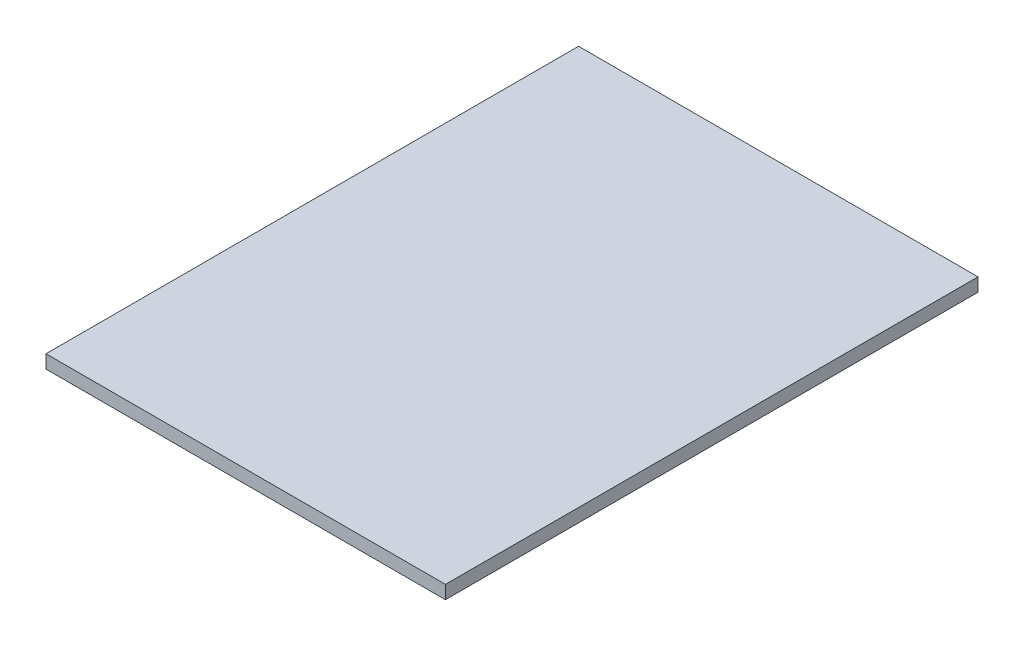
ISO-10303-21;
HEADER;
FILE_DESCRIPTION(('STEP AP214'),'2;1');
FILE_NAME('part.step','',(''),(''),'','','');
FILE_SCHEMA(('AUTOMOTIVE_DESIGN { 1 0 10303 214 1 1 1 1 }'));
ENDSEC;
DATA;
#1=APPLICATION_CONTEXT('core data for automotive mechanical design processes');
#2=APPLICATION_PROTOCOL_DEFINITION('international standard','automotive_design',2000,#1);
#3=PRODUCT_CONTEXT('',#1,'mechanical');
#4=PRODUCT('Part','Part','',(#3));
#5=PRODUCT_RELATED_PRODUCT_CATEGORY('part','',(#4));
#6=PRODUCT_DEFINITION_FORMATION('','',#4);
#7=PRODUCT_DEFINITION_CONTEXT('part definition',#1,'design');
#8=PRODUCT_DEFINITION('design','',#6,#7);
#9=PRODUCT_DEFINITION_SHAPE('','',#8);
#10=(LENGTH_UNIT() NAMED_UNIT(*) SI_UNIT(.MILLI.,.METRE.));
#11=(NAMED_UNIT(*) PLANE_ANGLE_UNIT() SI_UNIT($,.RADIAN.));
#12=(NAMED_UNIT(*) SI_UNIT($,.STERADIAN.) SOLID_ANGLE_UNIT());
#13=UNCERTAINTY_MEASURE_WITH_UNIT(LENGTH_MEASURE(1.E-05),#10,'distance_accuracy_value','');
#14=(GEOMETRIC_REPRESENTATION_CONTEXT(3) GLOBAL_UNCERTAINTY_ASSIGNED_CONTEXT((#13)) GLOBAL_UNIT_ASSIGNED_CONTEXT((#10,
#11,#12)) REPRESENTATION_CONTEXT('',''));
#15=CARTESIAN_POINT('',(0.,0.,0.));
#16=DIRECTION('',(0.,0.,1.));
#17=DIRECTION('',(1.,0.,0.));
#18=AXIS2_PLACEMENT_3D('',#15,#16,#17);
#19=CARTESIAN_POINT('',(0.,10.,0.));
#20=DIRECTION('',(1.,0.,0.));
#21=DIRECTION('',(0.,0.,-1.));
#22=AXIS2_PLACEMENT_3D('',#19,#20,#21);
#23=PLANE('',#22);
#24=DIRECTION('',(0.,0.,1.));
#25=VECTOR('',#24,1.);
#26=CARTESIAN_POINT('',(0.,0.,0.));
#27=LINE('',#26,#25);
#28=CARTESIAN_POINT('',(0.,0.,-400.));
#29=VERTEX_POINT('',#28);
#30=CARTESIAN_POINT('',(0.,0.,0.));
#31=VERTEX_POINT('',#30);
#32=EDGE_CURVE('E93',#29,#31,#27,.T.);
#33=ORIENTED_EDGE('',*,*,#32,.T.);
#34=DIRECTION('',(0.,-1.,0.));
#35=VECTOR('',#34,1.);
#36=CARTESIAN_POINT('',(0.,10.,0.));
#37=LINE('',#36,#35);
#38=CARTESIAN_POINT('',(0.,10.,0.));
#39=VERTEX_POINT('',#38);
#40=EDGE_CURVE('E11',#39,#31,#37,.T.);
#41=ORIENTED_EDGE('',*,*,#40,.F.);
#42=DIRECTION('',(0.,0.,1.));
#43=VECTOR('',#42,1.);
#44=CARTESIAN_POINT('',(0.,10.,0.));
#45=LINE('',#44,#43);
#46=CARTESIAN_POINT('',(0.,10.,-400.));
#47=VERTEX_POINT('',#46);
#48=EDGE_CURVE('E81',#47,#39,#45,.T.);
#49=ORIENTED_EDGE('',*,*,#48,.F.);
#50=DIRECTION('',(0.,-1.,0.));
#51=VECTOR('',#50,1.);
#52=CARTESIAN_POINT('',(0.,10.,-400.));
#53=LINE('',#52,#51);
#54=EDGE_CURVE('E89',#47,#29,#53,.T.);
#55=ORIENTED_EDGE('',*,*,#54,.T.);
#56=EDGE_LOOP('',(#33,#41,#49,#55));
#57=FACE_BOUND('',#56,.T.);
#58=ADVANCED_FACE('F30',(#57),#23,.F.);
#59=CARTESIAN_POINT('',(0.,10.,0.));
#60=DIRECTION('',(0.,0.,-1.));
#61=DIRECTION('',(-1.,0.,0.));
#62=AXIS2_PLACEMENT_3D('',#59,#60,#61);
#63=PLANE('',#62);
#64=DIRECTION('',(1.,0.,0.));
#65=VECTOR('',#64,1.);
#66=CARTESIAN_POINT('',(0.,0.,0.));
#67=LINE('',#66,#65);
#68=CARTESIAN_POINT('',(300.,0.,0.));
#69=VERTEX_POINT('',#68);
#70=EDGE_CURVE('E85',#31,#69,#67,.T.);
#71=ORIENTED_EDGE('',*,*,#70,.T.);
#72=DIRECTION('',(0.,-1.,0.));
#73=VECTOR('',#72,1.);
#74=CARTESIAN_POINT('',(300.,10.,0.));
#75=LINE('',#74,#73);
#76=CARTESIAN_POINT('',(300.,10.,0.));
#77=VERTEX_POINT('',#76);
#78=EDGE_CURVE('E38',#77,#69,#75,.T.);
#79=ORIENTED_EDGE('',*,*,#78,.F.);
#80=DIRECTION('',(1.,0.,0.));
#81=VECTOR('',#80,1.);
#82=CARTESIAN_POINT('',(0.,10.,0.));
#83=LINE('',#82,#81);
#84=EDGE_CURVE('E76',#39,#77,#83,.T.);
#85=ORIENTED_EDGE('',*,*,#84,.F.);
#86=ORIENTED_EDGE('',*,*,#40,.T.);
#87=EDGE_LOOP('',(#71,#79,#85,#86));
#88=FACE_BOUND('',#87,.T.);
#89=ADVANCED_FACE('F84',(#88),#63,.F.);
#90=CARTESIAN_POINT('',(300.,10.,0.));
#91=DIRECTION('',(-1.,0.,0.));
#92=DIRECTION('',(0.,0.,1.));
#93=AXIS2_PLACEMENT_3D('',#90,#91,#92);
#94=PLANE('',#93);
#95=DIRECTION('',(0.,0.,-1.));
#96=VECTOR('',#95,1.);
#97=CARTESIAN_POINT('',(300.,0.,0.));
#98=LINE('',#97,#96);
#99=CARTESIAN_POINT('',(300.,0.,-400.));
#100=VERTEX_POINT('',#99);
#101=EDGE_CURVE('E63',#69,#100,#98,.T.);
#102=ORIENTED_EDGE('',*,*,#101,.T.);
#103=DIRECTION('',(0.,-1.,0.));
#104=VECTOR('',#103,1.);
#105=CARTESIAN_POINT('',(300.,10.,-400.));
#106=LINE('',#105,#104);
#107=CARTESIAN_POINT('',(300.,10.,-400.));
#108=VERTEX_POINT('',#107);
#109=EDGE_CURVE('E86',#108,#100,#106,.T.);
#110=ORIENTED_EDGE('',*,*,#109,.F.);
#111=DIRECTION('',(0.,0.,-1.));
#112=VECTOR('',#111,1.);
#113=CARTESIAN_POINT('',(300.,10.,0.));
#114=LINE('',#113,#112);
#115=EDGE_CURVE('E79',#77,#108,#114,.T.);
#116=ORIENTED_EDGE('',*,*,#115,.F.);
#117=ORIENTED_EDGE('',*,*,#78,.T.);
#118=EDGE_LOOP('',(#102,#110,#116,#117));
#119=FACE_BOUND('',#118,.T.);
#120=ADVANCED_FACE('F87',(#119),#94,.F.);
#121=CARTESIAN_POINT('',(0.,10.,-400.));
#122=DIRECTION('',(0.,0.,1.));
#123=DIRECTION('',(1.,0.,0.));
#124=AXIS2_PLACEMENT_3D('',#121,#122,#123);
#125=PLANE('',#124);
#126=DIRECTION('',(-1.,0.,0.));
#127=VECTOR('',#126,1.);
#128=CARTESIAN_POINT('',(0.,0.,-400.));
#129=LINE('',#128,#127);
#130=EDGE_CURVE('E69',#100,#29,#129,.T.);
#131=ORIENTED_EDGE('',*,*,#130,.T.);
#132=ORIENTED_EDGE('',*,*,#54,.F.);
#133=DIRECTION('',(-1.,0.,0.));
#134=VECTOR('',#133,1.);
#135=CARTESIAN_POINT('',(0.,10.,-400.));
#136=LINE('',#135,#134);
#137=EDGE_CURVE('E46',#108,#47,#136,.T.);
#138=ORIENTED_EDGE('',*,*,#137,.F.);
#139=ORIENTED_EDGE('',*,*,#109,.T.);
#140=EDGE_LOOP('',(#131,#132,#138,#139));
#141=FACE_BOUND('',#140,.T.);
#142=ADVANCED_FACE('F100',(#141),#125,.F.);
#143=CARTESIAN_POINT('',(0.,10.,-400.));
#144=DIRECTION('',(0.,-1.,0.));
#145=DIRECTION('',(0.,0.,-1.));
#146=AXIS2_PLACEMENT_3D('',#143,#144,#145);
#147=PLANE('',#146);
#148=ORIENTED_EDGE('',*,*,#48,.T.);
#149=ORIENTED_EDGE('',*,*,#84,.T.);
#150=ORIENTED_EDGE('',*,*,#115,.T.);
#151=ORIENTED_EDGE('',*,*,#137,.T.);
#152=EDGE_LOOP('',(#148,#149,#150,#151));
#153=FACE_BOUND('',#152,.T.);
#154=ADVANCED_FACE('F77',(#153),#147,.F.);
#155=CARTESIAN_POINT('',(0.,0.,-400.));
#156=DIRECTION('',(0.,-1.,0.));
#157=DIRECTION('',(0.,0.,-1.));
#158=AXIS2_PLACEMENT_3D('',#155,#156,#157);
#159=PLANE('',#158);
#160=ORIENTED_EDGE('',*,*,#32,.F.);
#161=ORIENTED_EDGE('',*,*,#130,.F.);
#162=ORIENTED_EDGE('',*,*,#101,.F.);
#163=ORIENTED_EDGE('',*,*,#70,.F.);
#164=EDGE_LOOP('',(#160,#161,#162,#163));
#165=FACE_BOUND('',#164,.T.);
#166=ADVANCED_FACE('F103',(#165),#159,.T.);
#167=CLOSED_SHELL('',(#58,#89,#120,#142,#154,#166));
#168=MANIFOLD_SOLID_BREP('B2',#167);
#169=ADVANCED_BREP_SHAPE_REPRESENTATION('',(#18,#168),#14);
#170=SHAPE_DEFINITION_REPRESENTATION(#9,#169);
ENDSEC;
END-ISO-10303-21;
